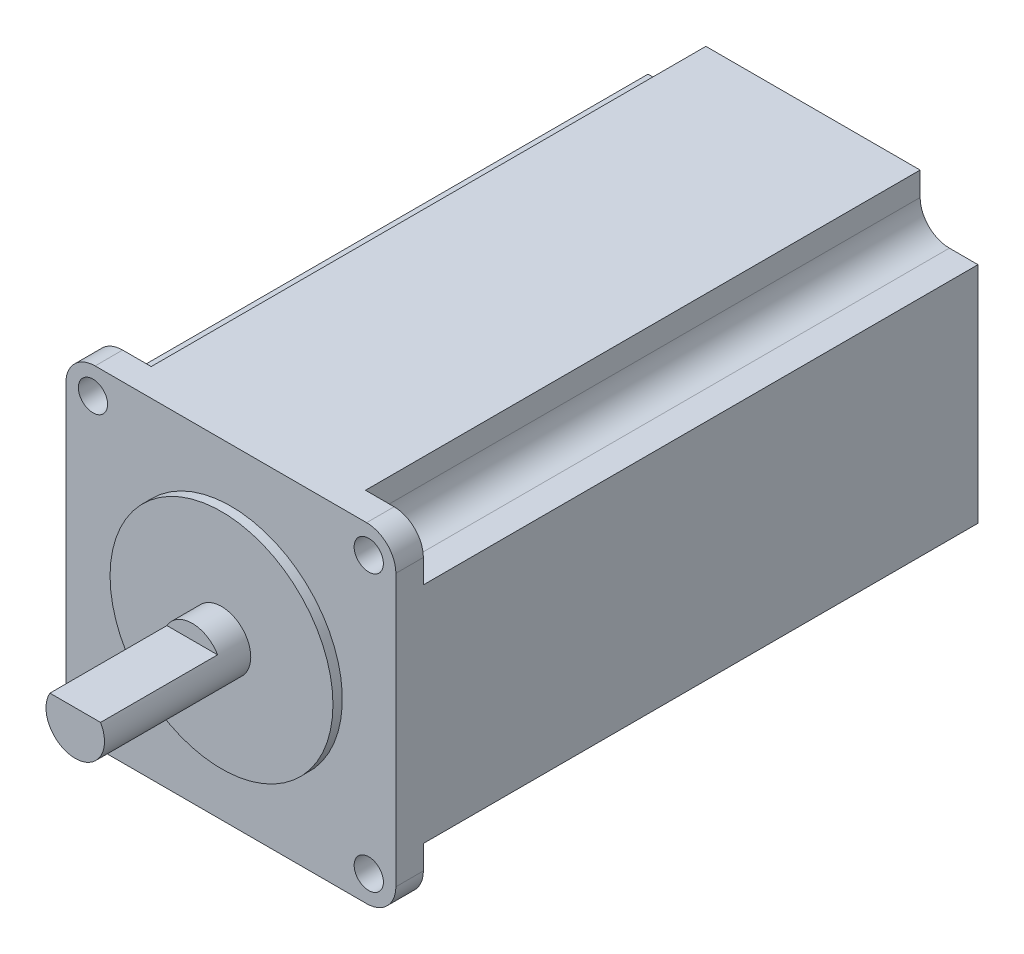
ISO-10303-21;
HEADER;
FILE_DESCRIPTION(('STEP AP214'),'2;1');
FILE_NAME('part.step','',(''),(''),'','','');
FILE_SCHEMA(('AUTOMOTIVE_DESIGN { 1 0 10303 214 1 1 1 1 }'));
ENDSEC;
DATA;
#1=APPLICATION_CONTEXT('core data for automotive mechanical design processes');
#2=APPLICATION_PROTOCOL_DEFINITION('international standard','automotive_design',2000,#1);
#3=PRODUCT_CONTEXT('',#1,'mechanical');
#4=PRODUCT('Part','Part','',(#3));
#5=PRODUCT_RELATED_PRODUCT_CATEGORY('part','',(#4));
#6=PRODUCT_DEFINITION_FORMATION('','',#4);
#7=PRODUCT_DEFINITION_CONTEXT('part definition',#1,'design');
#8=PRODUCT_DEFINITION('design','',#6,#7);
#9=PRODUCT_DEFINITION_SHAPE('','',#8);
#10=(LENGTH_UNIT() NAMED_UNIT(*) SI_UNIT(.MILLI.,.METRE.));
#11=(NAMED_UNIT(*) PLANE_ANGLE_UNIT() SI_UNIT($,.RADIAN.));
#12=(NAMED_UNIT(*) SI_UNIT($,.STERADIAN.) SOLID_ANGLE_UNIT());
#13=UNCERTAINTY_MEASURE_WITH_UNIT(LENGTH_MEASURE(1.E-05),#10,'distance_accuracy_value','');
#14=(GEOMETRIC_REPRESENTATION_CONTEXT(3) GLOBAL_UNCERTAINTY_ASSIGNED_CONTEXT((#13)) GLOBAL_UNIT_ASSIGNED_CONTEXT((#10,
#11,#12)) REPRESENTATION_CONTEXT('',''));
#15=CARTESIAN_POINT('',(0.,0.,0.));
#16=DIRECTION('',(0.,0.,1.));
#17=DIRECTION('',(1.,0.,0.));
#18=AXIS2_PLACEMENT_3D('',#15,#16,#17);
#19=CARTESIAN_POINT('',(0.,0.,99.5));
#20=DIRECTION('',(1.,0.,0.));
#21=DIRECTION('',(0.,0.,-1.));
#22=AXIS2_PLACEMENT_3D('',#19,#20,#21);
#23=PLANE('',#22);
#24=DIRECTION('',(0.,1.,0.));
#25=VECTOR('',#24,1.);
#26=CARTESIAN_POINT('',(0.,0.,94.8));
#27=LINE('',#26,#25);
#28=CARTESIAN_POINT('',(0.,5.,94.8));
#29=VERTEX_POINT('',#28);
#30=CARTESIAN_POINT('',(0.,9.05929943888165,94.8));
#31=VERTEX_POINT('',#30);
#32=EDGE_CURVE('E297',#29,#31,#27,.T.);
#33=ORIENTED_EDGE('',*,*,#32,.F.);
#34=DIRECTION('',(0.,0.,-1.));
#35=VECTOR('',#34,1.);
#36=CARTESIAN_POINT('',(0.,5.,99.5));
#37=LINE('',#36,#35);
#38=CARTESIAN_POINT('',(0.,5.,99.5));
#39=VERTEX_POINT('',#38);
#40=EDGE_CURVE('E411',#29,#39,#37,.F.);
#41=ORIENTED_EDGE('',*,*,#40,.T.);
#42=DIRECTION('',(0.,-1.,0.));
#43=VECTOR('',#42,1.);
#44=CARTESIAN_POINT('',(0.,0.,99.5));
#45=LINE('',#44,#43);
#46=CARTESIAN_POINT('',(0.,51.4,99.5));
#47=VERTEX_POINT('',#46);
#48=EDGE_CURVE('E345',#47,#39,#45,.T.);
#49=ORIENTED_EDGE('',*,*,#48,.F.);
#50=DIRECTION('',(0.,0.,-1.));
#51=VECTOR('',#50,1.);
#52=CARTESIAN_POINT('',(0.,51.4,99.5));
#53=LINE('',#52,#51);
#54=CARTESIAN_POINT('',(0.,51.4,94.8));
#55=VERTEX_POINT('',#54);
#56=EDGE_CURVE('E408',#47,#55,#53,.T.);
#57=ORIENTED_EDGE('',*,*,#56,.T.);
#58=DIRECTION('',(0.,-1.,0.));
#59=VECTOR('',#58,1.);
#60=CARTESIAN_POINT('',(0.,0.,94.8));
#61=LINE('',#60,#59);
#62=CARTESIAN_POINT('',(0.,47.3407005611183,94.8));
#63=VERTEX_POINT('',#62);
#64=EDGE_CURVE('E292',#55,#63,#61,.T.);
#65=ORIENTED_EDGE('',*,*,#64,.T.);
#66=DIRECTION('',(0.,0.,-1.));
#67=VECTOR('',#66,1.);
#68=CARTESIAN_POINT('',(0.,47.3407005611183,99.5));
#69=LINE('',#68,#67);
#70=CARTESIAN_POINT('',(0.,47.3407005611183,0.));
#71=VERTEX_POINT('',#70);
#72=EDGE_CURVE('E289',#63,#71,#69,.T.);
#73=ORIENTED_EDGE('',*,*,#72,.T.);
#74=DIRECTION('',(0.,-1.,0.));
#75=VECTOR('',#74,1.);
#76=CARTESIAN_POINT('',(0.,0.,0.));
#77=LINE('',#76,#75);
#78=CARTESIAN_POINT('',(0.,9.05929943888165,0.));
#79=VERTEX_POINT('',#78);
#80=EDGE_CURVE('E344',#71,#79,#77,.T.);
#81=ORIENTED_EDGE('',*,*,#80,.T.);
#82=DIRECTION('',(0.,0.,1.));
#83=VECTOR('',#82,1.);
#84=CARTESIAN_POINT('',(0.,9.05929943888165,99.5));
#85=LINE('',#84,#83);
#86=EDGE_CURVE('E281',#79,#31,#85,.T.);
#87=ORIENTED_EDGE('',*,*,#86,.T.);
#88=EDGE_LOOP('',(#33,#41,#49,#57,#65,#73,#81,#87));
#89=FACE_BOUND('',#88,.T.);
#90=ADVANCED_FACE('F35',(#89),#23,.F.);
#91=CARTESIAN_POINT('',(0.,0.,99.5));
#92=DIRECTION('',(0.,1.,0.));
#93=DIRECTION('',(0.,0.,1.));
#94=AXIS2_PLACEMENT_3D('',#91,#92,#93);
#95=PLANE('',#94);
#96=DIRECTION('',(1.,0.,0.));
#97=VECTOR('',#96,1.);
#98=CARTESIAN_POINT('',(0.,0.,99.5));
#99=LINE('',#98,#97);
#100=CARTESIAN_POINT('',(5.,0.,99.5));
#101=VERTEX_POINT('',#100);
#102=CARTESIAN_POINT('',(51.4,0.,99.5));
#103=VERTEX_POINT('',#102);
#104=EDGE_CURVE('E348',#101,#103,#99,.T.);
#105=ORIENTED_EDGE('',*,*,#104,.F.);
#106=DIRECTION('',(0.,0.,-1.));
#107=VECTOR('',#106,1.);
#108=CARTESIAN_POINT('',(5.,0.,99.5));
#109=LINE('',#108,#107);
#110=CARTESIAN_POINT('',(5.,0.,94.8));
#111=VERTEX_POINT('',#110);
#112=EDGE_CURVE('E403',#101,#111,#109,.T.);
#113=ORIENTED_EDGE('',*,*,#112,.T.);
#114=DIRECTION('',(-1.,0.,0.));
#115=VECTOR('',#114,1.);
#116=CARTESIAN_POINT('',(0.,0.,94.8));
#117=LINE('',#116,#115);
#118=CARTESIAN_POINT('',(9.88986238236256,0.,94.8));
#119=VERTEX_POINT('',#118);
#120=EDGE_CURVE('E385',#119,#111,#117,.T.);
#121=ORIENTED_EDGE('',*,*,#120,.F.);
#122=DIRECTION('',(0.,0.,-1.));
#123=VECTOR('',#122,1.);
#124=CARTESIAN_POINT('',(9.88986238236256,0.,99.5));
#125=LINE('',#124,#123);
#126=CARTESIAN_POINT('',(9.88986238236256,0.,0.));
#127=VERTEX_POINT('',#126);
#128=EDGE_CURVE('E284',#119,#127,#125,.T.);
#129=ORIENTED_EDGE('',*,*,#128,.T.);
#130=DIRECTION('',(1.,0.,0.));
#131=VECTOR('',#130,1.);
#132=CARTESIAN_POINT('',(0.,0.,0.));
#133=LINE('',#132,#131);
#134=CARTESIAN_POINT('',(46.5101376176374,0.,0.));
#135=VERTEX_POINT('',#134);
#136=EDGE_CURVE('E361',#127,#135,#133,.T.);
#137=ORIENTED_EDGE('',*,*,#136,.T.);
#138=DIRECTION('',(0.,0.,1.));
#139=VECTOR('',#138,1.);
#140=CARTESIAN_POINT('',(46.5101376176374,0.,99.5));
#141=LINE('',#140,#139);
#142=CARTESIAN_POINT('',(46.5101376176374,0.,94.8));
#143=VERTEX_POINT('',#142);
#144=EDGE_CURVE('E278',#135,#143,#141,.T.);
#145=ORIENTED_EDGE('',*,*,#144,.T.);
#146=DIRECTION('',(1.,0.,0.));
#147=VECTOR('',#146,1.);
#148=CARTESIAN_POINT('',(0.,0.,94.8));
#149=LINE('',#148,#147);
#150=CARTESIAN_POINT('',(51.4,0.,94.8));
#151=VERTEX_POINT('',#150);
#152=EDGE_CURVE('E294',#143,#151,#149,.T.);
#153=ORIENTED_EDGE('',*,*,#152,.T.);
#154=DIRECTION('',(0.,0.,-1.));
#155=VECTOR('',#154,1.);
#156=CARTESIAN_POINT('',(51.4,0.,99.5));
#157=LINE('',#156,#155);
#158=EDGE_CURVE('E388',#151,#103,#157,.F.);
#159=ORIENTED_EDGE('',*,*,#158,.T.);
#160=EDGE_LOOP('',(#105,#113,#121,#129,#137,#145,#153,#159));
#161=FACE_BOUND('',#160,.T.);
#162=ADVANCED_FACE('F473',(#161),#95,.F.);
#163=CARTESIAN_POINT('',(56.4,0.,99.5));
#164=DIRECTION('',(-1.,0.,0.));
#165=DIRECTION('',(0.,0.,1.));
#166=AXIS2_PLACEMENT_3D('',#163,#164,#165);
#167=PLANE('',#166);
#168=DIRECTION('',(0.,1.,0.));
#169=VECTOR('',#168,1.);
#170=CARTESIAN_POINT('',(56.4,0.,99.5));
#171=LINE('',#170,#169);
#172=CARTESIAN_POINT('',(56.4,5.,99.5));
#173=VERTEX_POINT('',#172);
#174=CARTESIAN_POINT('',(56.4,51.4,99.5));
#175=VERTEX_POINT('',#174);
#176=EDGE_CURVE('E352',#173,#175,#171,.T.);
#177=ORIENTED_EDGE('',*,*,#176,.F.);
#178=DIRECTION('',(0.,0.,-1.));
#179=VECTOR('',#178,1.);
#180=CARTESIAN_POINT('',(56.4,5.,99.5));
#181=LINE('',#180,#179);
#182=CARTESIAN_POINT('',(56.4,5.,94.8));
#183=VERTEX_POINT('',#182);
#184=EDGE_CURVE('E423',#173,#183,#181,.T.);
#185=ORIENTED_EDGE('',*,*,#184,.T.);
#186=DIRECTION('',(0.,1.,0.));
#187=VECTOR('',#186,1.);
#188=CARTESIAN_POINT('',(56.4,0.,94.8));
#189=LINE('',#188,#187);
#190=CARTESIAN_POINT('',(56.4,9.05929943888165,94.8));
#191=VERTEX_POINT('',#190);
#192=EDGE_CURVE('E383',#183,#191,#189,.T.);
#193=ORIENTED_EDGE('',*,*,#192,.T.);
#194=DIRECTION('',(0.,0.,-1.));
#195=VECTOR('',#194,1.);
#196=CARTESIAN_POINT('',(56.4,9.05929943888165,99.5));
#197=LINE('',#196,#195);
#198=CARTESIAN_POINT('',(56.4,9.05929943888165,0.));
#199=VERTEX_POINT('',#198);
#200=EDGE_CURVE('E238',#191,#199,#197,.T.);
#201=ORIENTED_EDGE('',*,*,#200,.T.);
#202=DIRECTION('',(0.,1.,0.));
#203=VECTOR('',#202,1.);
#204=CARTESIAN_POINT('',(56.4,0.,0.));
#205=LINE('',#204,#203);
#206=CARTESIAN_POINT('',(56.4,47.3407005611183,0.));
#207=VERTEX_POINT('',#206);
#208=EDGE_CURVE('E364',#199,#207,#205,.T.);
#209=ORIENTED_EDGE('',*,*,#208,.T.);
#210=DIRECTION('',(0.,0.,1.));
#211=VECTOR('',#210,1.);
#212=CARTESIAN_POINT('',(56.4,47.3407005611183,99.5));
#213=LINE('',#212,#211);
#214=CARTESIAN_POINT('',(56.4,47.3407005611183,94.8));
#215=VERTEX_POINT('',#214);
#216=EDGE_CURVE('E315',#207,#215,#213,.T.);
#217=ORIENTED_EDGE('',*,*,#216,.T.);
#218=DIRECTION('',(0.,-1.,0.));
#219=VECTOR('',#218,1.);
#220=CARTESIAN_POINT('',(56.4,0.,94.8));
#221=LINE('',#220,#219);
#222=CARTESIAN_POINT('',(56.4,51.4,94.8));
#223=VERTEX_POINT('',#222);
#224=EDGE_CURVE('E323',#223,#215,#221,.T.);
#225=ORIENTED_EDGE('',*,*,#224,.F.);
#226=DIRECTION('',(0.,0.,-1.));
#227=VECTOR('',#226,1.);
#228=CARTESIAN_POINT('',(56.4,51.4,99.5));
#229=LINE('',#228,#227);
#230=EDGE_CURVE('E421',#223,#175,#229,.F.);
#231=ORIENTED_EDGE('',*,*,#230,.T.);
#232=EDGE_LOOP('',(#177,#185,#193,#201,#209,#217,#225,#231));
#233=FACE_BOUND('',#232,.T.);
#234=ADVANCED_FACE('F480',(#233),#167,.F.);
#235=CARTESIAN_POINT('',(0.,56.4,99.5));
#236=DIRECTION('',(0.,-1.,0.));
#237=DIRECTION('',(0.,0.,-1.));
#238=AXIS2_PLACEMENT_3D('',#235,#236,#237);
#239=PLANE('',#238);
#240=DIRECTION('',(-1.,0.,0.));
#241=VECTOR('',#240,1.);
#242=CARTESIAN_POINT('',(0.,56.4,94.8));
#243=LINE('',#242,#241);
#244=CARTESIAN_POINT('',(9.88986238236256,56.4,94.8));
#245=VERTEX_POINT('',#244);
#246=CARTESIAN_POINT('',(5.,56.4,94.8));
#247=VERTEX_POINT('',#246);
#248=EDGE_CURVE('E212',#245,#247,#243,.T.);
#249=ORIENTED_EDGE('',*,*,#248,.T.);
#250=DIRECTION('',(0.,0.,-1.));
#251=VECTOR('',#250,1.);
#252=CARTESIAN_POINT('',(5.,56.4,99.5));
#253=LINE('',#252,#251);
#254=CARTESIAN_POINT('',(5.,56.4,99.5));
#255=VERTEX_POINT('',#254);
#256=EDGE_CURVE('E43',#247,#255,#253,.F.);
#257=ORIENTED_EDGE('',*,*,#256,.T.);
#258=DIRECTION('',(-1.,0.,0.));
#259=VECTOR('',#258,1.);
#260=CARTESIAN_POINT('',(0.,56.4,99.5));
#261=LINE('',#260,#259);
#262=CARTESIAN_POINT('',(51.4,56.4,99.5));
#263=VERTEX_POINT('',#262);
#264=EDGE_CURVE('E355',#263,#255,#261,.T.);
#265=ORIENTED_EDGE('',*,*,#264,.F.);
#266=DIRECTION('',(0.,0.,-1.));
#267=VECTOR('',#266,1.);
#268=CARTESIAN_POINT('',(51.4,56.4,99.5));
#269=LINE('',#268,#267);
#270=CARTESIAN_POINT('',(51.4,56.4,94.8));
#271=VERTEX_POINT('',#270);
#272=EDGE_CURVE('E429',#263,#271,#269,.T.);
#273=ORIENTED_EDGE('',*,*,#272,.T.);
#274=DIRECTION('',(1.,0.,0.));
#275=VECTOR('',#274,1.);
#276=CARTESIAN_POINT('',(0.,56.4,94.8));
#277=LINE('',#276,#275);
#278=CARTESIAN_POINT('',(46.5101376176374,56.4,94.8));
#279=VERTEX_POINT('',#278);
#280=EDGE_CURVE('E374',#279,#271,#277,.T.);
#281=ORIENTED_EDGE('',*,*,#280,.F.);
#282=DIRECTION('',(0.,0.,-1.));
#283=VECTOR('',#282,1.);
#284=CARTESIAN_POINT('',(46.5101376176374,56.4,99.5));
#285=LINE('',#284,#283);
#286=CARTESIAN_POINT('',(46.5101376176374,56.4,0.));
#287=VERTEX_POINT('',#286);
#288=EDGE_CURVE('E320',#279,#287,#285,.T.);
#289=ORIENTED_EDGE('',*,*,#288,.T.);
#290=DIRECTION('',(-1.,0.,0.));
#291=VECTOR('',#290,1.);
#292=CARTESIAN_POINT('',(0.,56.4,0.));
#293=LINE('',#292,#291);
#294=CARTESIAN_POINT('',(9.88986238236256,56.4,0.));
#295=VERTEX_POINT('',#294);
#296=EDGE_CURVE('E349',#287,#295,#293,.T.);
#297=ORIENTED_EDGE('',*,*,#296,.T.);
#298=DIRECTION('',(0.,0.,1.));
#299=VECTOR('',#298,1.);
#300=CARTESIAN_POINT('',(9.88986238236256,56.4,99.5));
#301=LINE('',#300,#299);
#302=EDGE_CURVE('E287',#295,#245,#301,.T.);
#303=ORIENTED_EDGE('',*,*,#302,.T.);
#304=EDGE_LOOP('',(#249,#257,#265,#273,#281,#289,#297,#303));
#305=FACE_BOUND('',#304,.T.);
#306=ADVANCED_FACE('F433',(#305),#239,.F.);
#307=CARTESIAN_POINT('',(0.,0.,99.5));
#308=DIRECTION('',(0.,0.,-1.));
#309=DIRECTION('',(-1.,0.,0.));
#310=AXIS2_PLACEMENT_3D('',#307,#308,#309);
#311=PLANE('',#310);
#312=CARTESIAN_POINT('',(51.77,51.77,99.5));
#313=DIRECTION('',(0.,0.,1.));
#314=DIRECTION('',(-1.,0.,0.));
#315=AXIS2_PLACEMENT_3D('',#312,#313,#314);
#316=CIRCLE('',#315,2.5);
#317=CARTESIAN_POINT('',(49.27,51.77,99.5));
#318=VERTEX_POINT('',#317);
#319=EDGE_CURVE('E396',#318,#318,#316,.T.);
#320=ORIENTED_EDGE('',*,*,#319,.F.);
#321=EDGE_LOOP('',(#320));
#322=FACE_BOUND('',#321,.T.);
#323=CARTESIAN_POINT('',(51.77,4.63,99.5));
#324=DIRECTION('',(0.,0.,1.));
#325=DIRECTION('',(1.,0.,0.));
#326=AXIS2_PLACEMENT_3D('',#323,#324,#325);
#327=CIRCLE('',#326,2.49999999999999);
#328=CARTESIAN_POINT('',(54.27,4.63,99.5));
#329=VERTEX_POINT('',#328);
#330=EDGE_CURVE('E852',#329,#329,#327,.T.);
#331=ORIENTED_EDGE('',*,*,#330,.F.);
#332=EDGE_LOOP('',(#331));
#333=FACE_BOUND('',#332,.T.);
#334=CARTESIAN_POINT('',(4.63,4.63,99.5));
#335=DIRECTION('',(0.,0.,1.));
#336=DIRECTION('',(-1.,0.,0.));
#337=AXIS2_PLACEMENT_3D('',#334,#335,#336);
#338=CIRCLE('',#337,2.5);
#339=CARTESIAN_POINT('',(2.13,4.63,99.5));
#340=VERTEX_POINT('',#339);
#341=EDGE_CURVE('E849',#340,#340,#338,.T.);
#342=ORIENTED_EDGE('',*,*,#341,.F.);
#343=EDGE_LOOP('',(#342));
#344=FACE_BOUND('',#343,.T.);
#345=CARTESIAN_POINT('',(4.63,51.77,99.5));
#346=DIRECTION('',(0.,0.,1.));
#347=DIRECTION('',(1.,0.,0.));
#348=AXIS2_PLACEMENT_3D('',#345,#346,#347);
#349=CIRCLE('',#348,2.5);
#350=CARTESIAN_POINT('',(7.13,51.77,99.5));
#351=VERTEX_POINT('',#350);
#352=EDGE_CURVE('E391',#351,#351,#349,.T.);
#353=ORIENTED_EDGE('',*,*,#352,.F.);
#354=EDGE_LOOP('',(#353));
#355=FACE_BOUND('',#354,.T.);
#356=CARTESIAN_POINT('',(28.2,28.2,99.5));
#357=DIRECTION('',(0.,0.,-1.));
#358=DIRECTION('',(-1.,0.,0.));
#359=AXIS2_PLACEMENT_3D('',#356,#357,#358);
#360=CIRCLE('',#359,19.05);
#361=CARTESIAN_POINT('',(9.15,28.2,99.5));
#362=VERTEX_POINT('',#361);
#363=EDGE_CURVE('E358',#362,#362,#360,.F.);
#364=ORIENTED_EDGE('',*,*,#363,.F.);
#365=EDGE_LOOP('',(#364));
#366=FACE_BOUND('',#365,.T.);
#367=ORIENTED_EDGE('',*,*,#48,.T.);
#368=CARTESIAN_POINT('',(5.,5.,99.5));
#369=DIRECTION('',(0.,0.,-1.));
#370=DIRECTION('',(-1.,0.,0.));
#371=AXIS2_PLACEMENT_3D('',#368,#369,#370);
#372=CIRCLE('',#371,5.);
#373=EDGE_CURVE('E419',#39,#101,#372,.F.);
#374=ORIENTED_EDGE('',*,*,#373,.T.);
#375=ORIENTED_EDGE('',*,*,#104,.T.);
#376=CARTESIAN_POINT('',(51.4,5.,99.5));
#377=DIRECTION('',(0.,0.,-1.));
#378=DIRECTION('',(-1.,0.,0.));
#379=AXIS2_PLACEMENT_3D('',#376,#377,#378);
#380=CIRCLE('',#379,5.);
#381=EDGE_CURVE('E417',#103,#173,#380,.F.);
#382=ORIENTED_EDGE('',*,*,#381,.T.);
#383=ORIENTED_EDGE('',*,*,#176,.T.);
#384=CARTESIAN_POINT('',(51.4,51.4,99.5));
#385=DIRECTION('',(0.,0.,-1.));
#386=DIRECTION('',(-1.,0.,0.));
#387=AXIS2_PLACEMENT_3D('',#384,#385,#386);
#388=CIRCLE('',#387,5.);
#389=EDGE_CURVE('E413',#175,#263,#388,.F.);
#390=ORIENTED_EDGE('',*,*,#389,.T.);
#391=ORIENTED_EDGE('',*,*,#264,.T.);
#392=CARTESIAN_POINT('',(5.,51.4,99.5));
#393=DIRECTION('',(0.,0.,-1.));
#394=DIRECTION('',(-1.,0.,0.));
#395=AXIS2_PLACEMENT_3D('',#392,#393,#394);
#396=CIRCLE('',#395,5.);
#397=EDGE_CURVE('E415',#255,#47,#396,.F.);
#398=ORIENTED_EDGE('',*,*,#397,.T.);
#399=EDGE_LOOP('',(#367,#374,#375,#382,#383,#390,#391,#398));
#400=FACE_BOUND('',#399,.T.);
#401=ADVANCED_FACE('F437',(#322,#333,#344,#355,#366,#400),#311,.F.);
#402=CARTESIAN_POINT('',(0.,0.,0.));
#403=DIRECTION('',(0.,0.,-1.));
#404=DIRECTION('',(-1.,0.,0.));
#405=AXIS2_PLACEMENT_3D('',#402,#403,#404);
#406=PLANE('',#405);
#407=DIRECTION('',(-1.,0.,0.));
#408=VECTOR('',#407,1.);
#409=CARTESIAN_POINT('',(-5.58881065522786,47.3407005611183,0.));
#410=LINE('',#409,#408);
#411=CARTESIAN_POINT('',(4.88986238236251,47.3407005611183,0.));
#412=VERTEX_POINT('',#411);
#413=EDGE_CURVE('E215',#412,#71,#410,.T.);
#414=ORIENTED_EDGE('',*,*,#413,.F.);
#415=CARTESIAN_POINT('',(4.88986238236256,52.3407005611183,0.));
#416=DIRECTION('',(0.,0.,-1.));
#417=DIRECTION('',(1.,0.,0.));
#418=AXIS2_PLACEMENT_3D('',#415,#416,#417);
#419=CIRCLE('',#418,5.);
#420=CARTESIAN_POINT('',(9.88986238236256,52.3407005611184,0.));
#421=VERTEX_POINT('',#420);
#422=EDGE_CURVE('E234',#421,#412,#419,.T.);
#423=ORIENTED_EDGE('',*,*,#422,.F.);
#424=DIRECTION('',(0.,-1.,0.));
#425=VECTOR('',#424,1.);
#426=CARTESIAN_POINT('',(9.88986238236256,0.,0.));
#427=LINE('',#426,#425);
#428=EDGE_CURVE('E221',#295,#421,#427,.T.);
#429=ORIENTED_EDGE('',*,*,#428,.F.);
#430=ORIENTED_EDGE('',*,*,#296,.F.);
#431=DIRECTION('',(0.,1.,0.));
#432=VECTOR('',#431,1.);
#433=CARTESIAN_POINT('',(46.5101376176374,58.0625131042298,0.));
#434=LINE('',#433,#432);
#435=CARTESIAN_POINT('',(46.5101376176374,52.3407005611184,0.));
#436=VERTEX_POINT('',#435);
#437=EDGE_CURVE('E303',#436,#287,#434,.T.);
#438=ORIENTED_EDGE('',*,*,#437,.F.);
#439=CARTESIAN_POINT('',(51.5101376176374,52.3407005611183,0.));
#440=DIRECTION('',(0.,0.,-1.));
#441=DIRECTION('',(-1.,0.,0.));
#442=AXIS2_PLACEMENT_3D('',#439,#440,#441);
#443=CIRCLE('',#442,5.);
#444=CARTESIAN_POINT('',(51.5101376176375,47.3407005611183,0.));
#445=VERTEX_POINT('',#444);
#446=EDGE_CURVE('E299',#445,#436,#443,.T.);
#447=ORIENTED_EDGE('',*,*,#446,.F.);
#448=DIRECTION('',(-1.,0.,0.));
#449=VECTOR('',#448,1.);
#450=CARTESIAN_POINT('',(0.,47.3407005611183,0.));
#451=LINE('',#450,#449);
#452=EDGE_CURVE('E372',#207,#445,#451,.T.);
#453=ORIENTED_EDGE('',*,*,#452,.F.);
#454=ORIENTED_EDGE('',*,*,#208,.F.);
#455=DIRECTION('',(1.,0.,0.));
#456=VECTOR('',#455,1.);
#457=CARTESIAN_POINT('',(61.9888106552279,9.05929943888165,0.));
#458=LINE('',#457,#456);
#459=CARTESIAN_POINT('',(51.5101376176375,9.05929943888165,0.));
#460=VERTEX_POINT('',#459);
#461=EDGE_CURVE('E262',#460,#199,#458,.T.);
#462=ORIENTED_EDGE('',*,*,#461,.F.);
#463=CARTESIAN_POINT('',(51.5101376176374,4.05929943888166,0.));
#464=DIRECTION('',(0.,0.,-1.));
#465=DIRECTION('',(1.,0.,0.));
#466=AXIS2_PLACEMENT_3D('',#463,#464,#465);
#467=CIRCLE('',#466,5.);
#468=CARTESIAN_POINT('',(46.5101376176374,4.05929943888162,0.));
#469=VERTEX_POINT('',#468);
#470=EDGE_CURVE('E268',#469,#460,#467,.T.);
#471=ORIENTED_EDGE('',*,*,#470,.F.);
#472=DIRECTION('',(0.,1.,0.));
#473=VECTOR('',#472,1.);
#474=CARTESIAN_POINT('',(46.5101376176374,0.,0.));
#475=LINE('',#474,#473);
#476=EDGE_CURVE('E377',#135,#469,#475,.T.);
#477=ORIENTED_EDGE('',*,*,#476,.F.);
#478=ORIENTED_EDGE('',*,*,#136,.F.);
#479=DIRECTION('',(0.,-1.,0.));
#480=VECTOR('',#479,1.);
#481=CARTESIAN_POINT('',(9.88986238236256,-1.66251310422976,0.));
#482=LINE('',#481,#480);
#483=CARTESIAN_POINT('',(9.88986238236256,4.05929943888162,0.));
#484=VERTEX_POINT('',#483);
#485=EDGE_CURVE('E243',#484,#127,#482,.T.);
#486=ORIENTED_EDGE('',*,*,#485,.F.);
#487=CARTESIAN_POINT('',(4.88986238236256,4.05929943888166,0.));
#488=DIRECTION('',(0.,0.,-1.));
#489=DIRECTION('',(-1.,0.,0.));
#490=AXIS2_PLACEMENT_3D('',#487,#488,#489);
#491=CIRCLE('',#490,5.);
#492=CARTESIAN_POINT('',(4.88986238236252,9.05929943888165,0.));
#493=VERTEX_POINT('',#492);
#494=EDGE_CURVE('E250',#493,#484,#491,.T.);
#495=ORIENTED_EDGE('',*,*,#494,.F.);
#496=DIRECTION('',(1.,0.,0.));
#497=VECTOR('',#496,1.);
#498=CARTESIAN_POINT('',(0.,9.05929943888165,0.));
#499=LINE('',#498,#497);
#500=EDGE_CURVE('E379',#79,#493,#499,.T.);
#501=ORIENTED_EDGE('',*,*,#500,.F.);
#502=ORIENTED_EDGE('',*,*,#80,.F.);
#503=EDGE_LOOP('',(#414,#423,#429,#430,#438,#447,#453,#454,#462,#471,#477,#478,#486,#495,#501,#502));
#504=FACE_BOUND('',#503,.T.);
#505=ADVANCED_FACE('F451',(#504),#406,.T.);
#506=CARTESIAN_POINT('',(28.2,28.2,101.1));
#507=DIRECTION('',(0.,0.,-1.));
#508=DIRECTION('',(-1.,0.,0.));
#509=AXIS2_PLACEMENT_3D('',#506,#507,#508);
#510=CYLINDRICAL_SURFACE('',#509,19.05);
#511=CARTESIAN_POINT('',(28.2,28.2,101.1));
#512=DIRECTION('',(0.,0.,1.));
#513=DIRECTION('',(1.,0.,0.));
#514=AXIS2_PLACEMENT_3D('',#511,#512,#513);
#515=CIRCLE('',#514,19.05);
#516=CARTESIAN_POINT('',(47.25,28.2,101.1));
#517=VERTEX_POINT('',#516);
#518=EDGE_CURVE('E339',#517,#517,#515,.T.);
#519=ORIENTED_EDGE('',*,*,#518,.F.);
#520=EDGE_LOOP('',(#519));
#521=FACE_BOUND('',#520,.T.);
#522=ORIENTED_EDGE('',*,*,#363,.T.);
#523=EDGE_LOOP('',(#522));
#524=FACE_BOUND('',#523,.T.);
#525=ADVANCED_FACE('F771',(#521,#524),#510,.T.);
#526=CARTESIAN_POINT('',(28.2,28.2,101.1));
#527=DIRECTION('',(0.,0.,1.));
#528=DIRECTION('',(1.,0.,0.));
#529=AXIS2_PLACEMENT_3D('',#526,#527,#528);
#530=PLANE('',#529);
#531=CARTESIAN_POINT('',(28.2,28.2,101.1));
#532=DIRECTION('',(0.,0.,1.));
#533=DIRECTION('',(1.,0.,0.));
#534=AXIS2_PLACEMENT_3D('',#531,#532,#533);
#535=CIRCLE('',#534,5.);
#536=CARTESIAN_POINT('',(33.2,28.2,101.1));
#537=VERTEX_POINT('',#536);
#538=EDGE_CURVE('E334',#537,#537,#535,.T.);
#539=ORIENTED_EDGE('',*,*,#538,.F.);
#540=EDGE_LOOP('',(#539));
#541=FACE_BOUND('',#540,.T.);
#542=ORIENTED_EDGE('',*,*,#518,.T.);
#543=EDGE_LOOP('',(#542));
#544=FACE_BOUND('',#543,.T.);
#545=ADVANCED_FACE('F810',(#541,#544),#530,.T.);
#546=CARTESIAN_POINT('',(28.2,28.2,126.1));
#547=DIRECTION('',(0.,0.,-1.));
#548=DIRECTION('',(-1.,0.,0.));
#549=AXIS2_PLACEMENT_3D('',#546,#547,#548);
#550=CYLINDRICAL_SURFACE('',#549,5.);
#551=CARTESIAN_POINT('',(28.2,28.2,126.1));
#552=DIRECTION('',(0.,0.,1.));
#553=DIRECTION('',(1.,0.,0.));
#554=AXIS2_PLACEMENT_3D('',#551,#552,#553);
#555=CIRCLE('',#554,5.);
#556=CARTESIAN_POINT('',(23.8698729810778,30.7,126.1));
#557=VERTEX_POINT('',#556);
#558=CARTESIAN_POINT('',(32.5301270189222,30.7,126.1));
#559=VERTEX_POINT('',#558);
#560=EDGE_CURVE('E336',#557,#559,#555,.T.);
#561=ORIENTED_EDGE('',*,*,#560,.F.);
#562=DIRECTION('',(0.,0.,1.));
#563=VECTOR('',#562,1.);
#564=CARTESIAN_POINT('',(23.8698729810778,30.7,106.1));
#565=LINE('',#564,#563);
#566=CARTESIAN_POINT('',(23.8698729810778,30.7,106.1));
#567=VERTEX_POINT('',#566);
#568=EDGE_CURVE('E329',#567,#557,#565,.T.);
#569=ORIENTED_EDGE('',*,*,#568,.F.);
#570=CARTESIAN_POINT('',(28.2,28.2,106.1));
#571=DIRECTION('',(0.,0.,1.));
#572=DIRECTION('',(1.,0.,0.));
#573=AXIS2_PLACEMENT_3D('',#570,#571,#572);
#574=CIRCLE('',#573,5.);
#575=CARTESIAN_POINT('',(32.5301270189222,30.7,106.1));
#576=VERTEX_POINT('',#575);
#577=EDGE_CURVE('E370',#576,#567,#574,.T.);
#578=ORIENTED_EDGE('',*,*,#577,.F.);
#579=DIRECTION('',(0.,0.,1.));
#580=VECTOR('',#579,1.);
#581=CARTESIAN_POINT('',(32.5301270189222,30.7,106.1));
#582=LINE('',#581,#580);
#583=EDGE_CURVE('E331',#576,#559,#582,.T.);
#584=ORIENTED_EDGE('',*,*,#583,.T.);
#585=EDGE_LOOP('',(#561,#569,#578,#584));
#586=FACE_BOUND('',#585,.T.);
#587=ORIENTED_EDGE('',*,*,#538,.T.);
#588=EDGE_LOOP('',(#587));
#589=FACE_BOUND('',#588,.T.);
#590=ADVANCED_FACE('F800',(#586,#589),#550,.T.);
#591=CARTESIAN_POINT('',(28.2,28.2,126.1));
#592=DIRECTION('',(0.,0.,1.));
#593=DIRECTION('',(1.,0.,0.));
#594=AXIS2_PLACEMENT_3D('',#591,#592,#593);
#595=PLANE('',#594);
#596=DIRECTION('',(1.,0.,0.));
#597=VECTOR('',#596,1.);
#598=CARTESIAN_POINT('',(23.8698729810778,30.7,126.1));
#599=LINE('',#598,#597);
#600=EDGE_CURVE('E325',#557,#559,#599,.T.);
#601=ORIENTED_EDGE('',*,*,#600,.F.);
#602=ORIENTED_EDGE('',*,*,#560,.T.);
#603=EDGE_LOOP('',(#601,#602));
#604=FACE_BOUND('',#603,.T.);
#605=ADVANCED_FACE('F790',(#604),#595,.T.);
#606=CARTESIAN_POINT('',(0.,0.,106.1));
#607=DIRECTION('',(0.,0.,1.));
#608=DIRECTION('',(1.,0.,0.));
#609=AXIS2_PLACEMENT_3D('',#606,#607,#608);
#610=PLANE('',#609);
#611=ORIENTED_EDGE('',*,*,#577,.T.);
#612=DIRECTION('',(1.,0.,0.));
#613=VECTOR('',#612,1.);
#614=CARTESIAN_POINT('',(23.8698729810778,30.7,106.1));
#615=LINE('',#614,#613);
#616=EDGE_CURVE('E326',#567,#576,#615,.T.);
#617=ORIENTED_EDGE('',*,*,#616,.T.);
#618=EDGE_LOOP('',(#611,#617));
#619=FACE_BOUND('',#618,.T.);
#620=ADVANCED_FACE('F780',(#619),#610,.T.);
#621=CARTESIAN_POINT('',(23.8698729810778,30.7,106.1));
#622=DIRECTION('',(0.,-1.,0.));
#623=DIRECTION('',(0.,0.,-1.));
#624=AXIS2_PLACEMENT_3D('',#621,#622,#623);
#625=PLANE('',#624);
#626=ORIENTED_EDGE('',*,*,#600,.T.);
#627=ORIENTED_EDGE('',*,*,#583,.F.);
#628=ORIENTED_EDGE('',*,*,#616,.F.);
#629=ORIENTED_EDGE('',*,*,#568,.T.);
#630=EDGE_LOOP('',(#626,#627,#628,#629));
#631=FACE_BOUND('',#630,.T.);
#632=ADVANCED_FACE('F610',(#631),#625,.F.);
#633=CARTESIAN_POINT('',(51.5101376176374,52.3407005611183,94.8));
#634=DIRECTION('',(0.,0.,-1.));
#635=DIRECTION('',(-1.,0.,0.));
#636=AXIS2_PLACEMENT_3D('',#633,#634,#635);
#637=PLANE('',#636);
#638=CARTESIAN_POINT('',(51.77,51.77,94.8));
#639=DIRECTION('',(0.,0.,-1.));
#640=DIRECTION('',(-1.,0.,0.));
#641=AXIS2_PLACEMENT_3D('',#638,#639,#640);
#642=CIRCLE('',#641,2.5);
#643=CARTESIAN_POINT('',(49.27,51.77,94.8));
#644=VERTEX_POINT('',#643);
#645=EDGE_CURVE('E399',#644,#644,#642,.T.);
#646=ORIENTED_EDGE('',*,*,#645,.F.);
#647=EDGE_LOOP('',(#646));
#648=FACE_BOUND('',#647,.T.);
#649=ORIENTED_EDGE('',*,*,#280,.T.);
#650=CARTESIAN_POINT('',(51.4,51.4,94.8));
#651=DIRECTION('',(0.,0.,-1.));
#652=DIRECTION('',(-1.,0.,0.));
#653=AXIS2_PLACEMENT_3D('',#650,#651,#652);
#654=CIRCLE('',#653,5.);
#655=EDGE_CURVE('E11',#271,#223,#654,.T.);
#656=ORIENTED_EDGE('',*,*,#655,.T.);
#657=ORIENTED_EDGE('',*,*,#224,.T.);
#658=DIRECTION('',(-1.,0.,0.));
#659=VECTOR('',#658,1.);
#660=CARTESIAN_POINT('',(61.9888106552279,47.3407005611183,94.8));
#661=LINE('',#660,#659);
#662=CARTESIAN_POINT('',(51.5101376176375,47.3407005611183,94.8));
#663=VERTEX_POINT('',#662);
#664=EDGE_CURVE('E300',#215,#663,#661,.T.);
#665=ORIENTED_EDGE('',*,*,#664,.T.);
#666=CARTESIAN_POINT('',(51.5101376176374,52.3407005611183,94.8));
#667=DIRECTION('',(0.,0.,-1.));
#668=DIRECTION('',(-1.,0.,0.));
#669=AXIS2_PLACEMENT_3D('',#666,#667,#668);
#670=CIRCLE('',#669,5.);
#671=CARTESIAN_POINT('',(46.5101376176374,52.3407005611184,94.8));
#672=VERTEX_POINT('',#671);
#673=EDGE_CURVE('E302',#663,#672,#670,.T.);
#674=ORIENTED_EDGE('',*,*,#673,.T.);
#675=DIRECTION('',(0.,1.,0.));
#676=VECTOR('',#675,1.);
#677=CARTESIAN_POINT('',(46.5101376176374,58.0625131042298,94.8));
#678=LINE('',#677,#676);
#679=EDGE_CURVE('E306',#672,#279,#678,.T.);
#680=ORIENTED_EDGE('',*,*,#679,.T.);
#681=EDGE_LOOP('',(#649,#656,#657,#665,#674,#680));
#682=FACE_BOUND('',#681,.T.);
#683=ADVANCED_FACE('F485',(#648,#682),#637,.T.);
#684=CARTESIAN_POINT('',(46.5101376176374,58.0625131042298,94.8));
#685=DIRECTION('',(-1.,0.,0.));
#686=DIRECTION('',(0.,0.,1.));
#687=AXIS2_PLACEMENT_3D('',#684,#685,#686);
#688=PLANE('',#687);
#689=ORIENTED_EDGE('',*,*,#679,.F.);
#690=DIRECTION('',(0.,0.,-1.));
#691=VECTOR('',#690,1.);
#692=CARTESIAN_POINT('',(46.5101376176374,52.3407005611184,94.8));
#693=LINE('',#692,#691);
#694=EDGE_CURVE('E313',#672,#436,#693,.T.);
#695=ORIENTED_EDGE('',*,*,#694,.T.);
#696=ORIENTED_EDGE('',*,*,#437,.T.);
#697=ORIENTED_EDGE('',*,*,#288,.F.);
#698=EDGE_LOOP('',(#689,#695,#696,#697));
#699=FACE_BOUND('',#698,.T.);
#700=ADVANCED_FACE('F489',(#699),#688,.F.);
#701=CARTESIAN_POINT('',(61.9888106552279,47.3407005611183,94.8));
#702=DIRECTION('',(0.,-1.,0.));
#703=DIRECTION('',(0.,0.,-1.));
#704=AXIS2_PLACEMENT_3D('',#701,#702,#703);
#705=PLANE('',#704);
#706=ORIENTED_EDGE('',*,*,#452,.T.);
#707=DIRECTION('',(0.,0.,-1.));
#708=VECTOR('',#707,1.);
#709=CARTESIAN_POINT('',(51.5101376176375,47.3407005611183,94.8));
#710=LINE('',#709,#708);
#711=EDGE_CURVE('E309',#663,#445,#710,.T.);
#712=ORIENTED_EDGE('',*,*,#711,.F.);
#713=ORIENTED_EDGE('',*,*,#664,.F.);
#714=ORIENTED_EDGE('',*,*,#216,.F.);
#715=EDGE_LOOP('',(#706,#712,#713,#714));
#716=FACE_BOUND('',#715,.T.);
#717=ADVANCED_FACE('F500',(#716),#705,.F.);
#718=CARTESIAN_POINT('',(51.5101376176374,52.3407005611183,94.8));
#719=DIRECTION('',(0.,0.,-1.));
#720=DIRECTION('',(-1.,0.,0.));
#721=AXIS2_PLACEMENT_3D('',#718,#719,#720);
#722=CYLINDRICAL_SURFACE('',#721,5.);
#723=ORIENTED_EDGE('',*,*,#446,.T.);
#724=ORIENTED_EDGE('',*,*,#694,.F.);
#725=ORIENTED_EDGE('',*,*,#673,.F.);
#726=ORIENTED_EDGE('',*,*,#711,.T.);
#727=EDGE_LOOP('',(#723,#724,#725,#726));
#728=FACE_BOUND('',#727,.T.);
#729=ADVANCED_FACE('F496',(#728),#722,.F.);
#730=CARTESIAN_POINT('',(51.5101376176374,4.05929943888166,94.8));
#731=DIRECTION('',(0.,0.,1.));
#732=DIRECTION('',(1.,0.,0.));
#733=AXIS2_PLACEMENT_3D('',#730,#731,#732);
#734=PLANE('',#733);
#735=CARTESIAN_POINT('',(51.77,4.63,94.8));
#736=DIRECTION('',(0.,0.,1.));
#737=DIRECTION('',(1.,0.,0.));
#738=AXIS2_PLACEMENT_3D('',#735,#736,#737);
#739=CIRCLE('',#738,2.49999999999999);
#740=CARTESIAN_POINT('',(54.27,4.63,94.8));
#741=VERTEX_POINT('',#740);
#742=EDGE_CURVE('E395',#741,#741,#739,.T.);
#743=ORIENTED_EDGE('',*,*,#742,.T.);
#744=EDGE_LOOP('',(#743));
#745=FACE_BOUND('',#744,.T.);
#746=ORIENTED_EDGE('',*,*,#192,.F.);
#747=CARTESIAN_POINT('',(51.4,5.,94.8));
#748=DIRECTION('',(0.,0.,1.));
#749=DIRECTION('',(1.,0.,0.));
#750=AXIS2_PLACEMENT_3D('',#747,#748,#749);
#751=CIRCLE('',#750,5.);
#752=EDGE_CURVE('E426',#183,#151,#751,.F.);
#753=ORIENTED_EDGE('',*,*,#752,.T.);
#754=ORIENTED_EDGE('',*,*,#152,.F.);
#755=DIRECTION('',(0.,1.,0.));
#756=VECTOR('',#755,1.);
#757=CARTESIAN_POINT('',(46.5101376176374,-1.66251310422976,94.8));
#758=LINE('',#757,#756);
#759=CARTESIAN_POINT('',(46.5101376176374,4.05929943888162,94.8));
#760=VERTEX_POINT('',#759);
#761=EDGE_CURVE('E265',#143,#760,#758,.T.);
#762=ORIENTED_EDGE('',*,*,#761,.T.);
#763=CARTESIAN_POINT('',(51.5101376176374,4.05929943888166,94.8));
#764=DIRECTION('',(0.,0.,-1.));
#765=DIRECTION('',(1.,0.,0.));
#766=AXIS2_PLACEMENT_3D('',#763,#764,#765);
#767=CIRCLE('',#766,5.);
#768=CARTESIAN_POINT('',(51.5101376176375,9.05929943888165,94.8));
#769=VERTEX_POINT('',#768);
#770=EDGE_CURVE('E258',#760,#769,#767,.T.);
#771=ORIENTED_EDGE('',*,*,#770,.T.);
#772=DIRECTION('',(1.,0.,0.));
#773=VECTOR('',#772,1.);
#774=CARTESIAN_POINT('',(61.9888106552279,9.05929943888165,94.8));
#775=LINE('',#774,#773);
#776=EDGE_CURVE('E261',#769,#191,#775,.T.);
#777=ORIENTED_EDGE('',*,*,#776,.T.);
#778=EDGE_LOOP('',(#746,#753,#754,#762,#771,#777));
#779=FACE_BOUND('',#778,.T.);
#780=ADVANCED_FACE('F592',(#745,#779),#734,.F.);
#781=CARTESIAN_POINT('',(46.5101376176374,-1.66251310422976,94.8));
#782=DIRECTION('',(-1.,0.,0.));
#783=DIRECTION('',(0.,0.,1.));
#784=AXIS2_PLACEMENT_3D('',#781,#782,#783);
#785=PLANE('',#784);
#786=ORIENTED_EDGE('',*,*,#476,.T.);
#787=DIRECTION('',(0.,0.,-1.));
#788=VECTOR('',#787,1.);
#789=CARTESIAN_POINT('',(46.5101376176374,4.05929943888162,94.8));
#790=LINE('',#789,#788);
#791=EDGE_CURVE('E253',#760,#469,#790,.T.);
#792=ORIENTED_EDGE('',*,*,#791,.F.);
#793=ORIENTED_EDGE('',*,*,#761,.F.);
#794=ORIENTED_EDGE('',*,*,#144,.F.);
#795=EDGE_LOOP('',(#786,#792,#793,#794));
#796=FACE_BOUND('',#795,.T.);
#797=ADVANCED_FACE('F515',(#796),#785,.F.);
#798=CARTESIAN_POINT('',(61.9888106552279,9.05929943888165,94.8));
#799=DIRECTION('',(0.,1.,0.));
#800=DIRECTION('',(0.,0.,1.));
#801=AXIS2_PLACEMENT_3D('',#798,#799,#800);
#802=PLANE('',#801);
#803=ORIENTED_EDGE('',*,*,#776,.F.);
#804=DIRECTION('',(0.,0.,-1.));
#805=VECTOR('',#804,1.);
#806=CARTESIAN_POINT('',(51.5101376176375,9.05929943888165,94.8));
#807=LINE('',#806,#805);
#808=EDGE_CURVE('E267',#769,#460,#807,.T.);
#809=ORIENTED_EDGE('',*,*,#808,.T.);
#810=ORIENTED_EDGE('',*,*,#461,.T.);
#811=ORIENTED_EDGE('',*,*,#200,.F.);
#812=EDGE_LOOP('',(#803,#809,#810,#811));
#813=FACE_BOUND('',#812,.T.);
#814=ADVANCED_FACE('F508',(#813),#802,.F.);
#815=CARTESIAN_POINT('',(51.5101376176374,4.05929943888166,94.8));
#816=DIRECTION('',(0.,0.,-1.));
#817=DIRECTION('',(-1.,0.,0.));
#818=AXIS2_PLACEMENT_3D('',#815,#816,#817);
#819=CYLINDRICAL_SURFACE('',#818,5.);
#820=ORIENTED_EDGE('',*,*,#470,.T.);
#821=ORIENTED_EDGE('',*,*,#808,.F.);
#822=ORIENTED_EDGE('',*,*,#770,.F.);
#823=ORIENTED_EDGE('',*,*,#791,.T.);
#824=EDGE_LOOP('',(#820,#821,#822,#823));
#825=FACE_BOUND('',#824,.T.);
#826=ADVANCED_FACE('F511',(#825),#819,.F.);
#827=CARTESIAN_POINT('',(4.88986238236256,4.05929943888166,94.8));
#828=DIRECTION('',(0.,0.,-1.));
#829=DIRECTION('',(-1.,0.,0.));
#830=AXIS2_PLACEMENT_3D('',#827,#828,#829);
#831=PLANE('',#830);
#832=CARTESIAN_POINT('',(4.63,4.63,94.8));
#833=DIRECTION('',(0.,0.,-1.));
#834=DIRECTION('',(-1.,0.,0.));
#835=AXIS2_PLACEMENT_3D('',#832,#833,#834);
#836=CIRCLE('',#835,2.5);
#837=CARTESIAN_POINT('',(2.13,4.63,94.8));
#838=VERTEX_POINT('',#837);
#839=EDGE_CURVE('E392',#838,#838,#836,.T.);
#840=ORIENTED_EDGE('',*,*,#839,.F.);
#841=EDGE_LOOP('',(#840));
#842=FACE_BOUND('',#841,.T.);
#843=ORIENTED_EDGE('',*,*,#120,.T.);
#844=CARTESIAN_POINT('',(5.,5.,94.8));
#845=DIRECTION('',(0.,0.,-1.));
#846=DIRECTION('',(-1.,0.,0.));
#847=AXIS2_PLACEMENT_3D('',#844,#845,#846);
#848=CIRCLE('',#847,5.);
#849=EDGE_CURVE('E406',#111,#29,#848,.T.);
#850=ORIENTED_EDGE('',*,*,#849,.T.);
#851=ORIENTED_EDGE('',*,*,#32,.T.);
#852=DIRECTION('',(1.,0.,0.));
#853=VECTOR('',#852,1.);
#854=CARTESIAN_POINT('',(-5.58881065522786,9.05929943888165,94.8));
#855=LINE('',#854,#853);
#856=CARTESIAN_POINT('',(4.88986238236252,9.05929943888165,94.8));
#857=VERTEX_POINT('',#856);
#858=EDGE_CURVE('E240',#31,#857,#855,.T.);
#859=ORIENTED_EDGE('',*,*,#858,.T.);
#860=CARTESIAN_POINT('',(4.88986238236256,4.05929943888166,94.8));
#861=DIRECTION('',(0.,0.,-1.));
#862=DIRECTION('',(-1.,0.,0.));
#863=AXIS2_PLACEMENT_3D('',#860,#861,#862);
#864=CIRCLE('',#863,5.);
#865=CARTESIAN_POINT('',(9.88986238236256,4.05929943888162,94.8));
#866=VERTEX_POINT('',#865);
#867=EDGE_CURVE('E242',#857,#866,#864,.T.);
#868=ORIENTED_EDGE('',*,*,#867,.T.);
#869=DIRECTION('',(0.,-1.,0.));
#870=VECTOR('',#869,1.);
#871=CARTESIAN_POINT('',(9.88986238236256,-1.66251310422976,94.8));
#872=LINE('',#871,#870);
#873=EDGE_CURVE('E246',#866,#119,#872,.T.);
#874=ORIENTED_EDGE('',*,*,#873,.T.);
#875=EDGE_LOOP('',(#843,#850,#851,#859,#868,#874));
#876=FACE_BOUND('',#875,.T.);
#877=ADVANCED_FACE('F463',(#842,#876),#831,.T.);
#878=CARTESIAN_POINT('',(9.88986238236256,-1.66251310422976,94.8));
#879=DIRECTION('',(1.,0.,0.));
#880=DIRECTION('',(0.,0.,-1.));
#881=AXIS2_PLACEMENT_3D('',#878,#879,#880);
#882=PLANE('',#881);
#883=ORIENTED_EDGE('',*,*,#873,.F.);
#884=DIRECTION('',(0.,0.,-1.));
#885=VECTOR('',#884,1.);
#886=CARTESIAN_POINT('',(9.88986238236256,4.05929943888162,94.8));
#887=LINE('',#886,#885);
#888=EDGE_CURVE('E236',#866,#484,#887,.T.);
#889=ORIENTED_EDGE('',*,*,#888,.T.);
#890=ORIENTED_EDGE('',*,*,#485,.T.);
#891=ORIENTED_EDGE('',*,*,#128,.F.);
#892=EDGE_LOOP('',(#883,#889,#890,#891));
#893=FACE_BOUND('',#892,.T.);
#894=ADVANCED_FACE('F518',(#893),#882,.F.);
#895=CARTESIAN_POINT('',(-5.58881065522786,9.05929943888165,94.8));
#896=DIRECTION('',(0.,1.,0.));
#897=DIRECTION('',(0.,0.,1.));
#898=AXIS2_PLACEMENT_3D('',#895,#896,#897);
#899=PLANE('',#898);
#900=ORIENTED_EDGE('',*,*,#500,.T.);
#901=DIRECTION('',(0.,0.,-1.));
#902=VECTOR('',#901,1.);
#903=CARTESIAN_POINT('',(4.88986238236252,9.05929943888165,94.8));
#904=LINE('',#903,#902);
#905=EDGE_CURVE('E249',#857,#493,#904,.T.);
#906=ORIENTED_EDGE('',*,*,#905,.F.);
#907=ORIENTED_EDGE('',*,*,#858,.F.);
#908=ORIENTED_EDGE('',*,*,#86,.F.);
#909=EDGE_LOOP('',(#900,#906,#907,#908));
#910=FACE_BOUND('',#909,.T.);
#911=ADVANCED_FACE('F456',(#910),#899,.F.);
#912=CARTESIAN_POINT('',(4.88986238236256,4.05929943888166,94.8));
#913=DIRECTION('',(0.,0.,-1.));
#914=DIRECTION('',(-1.,0.,0.));
#915=AXIS2_PLACEMENT_3D('',#912,#913,#914);
#916=CYLINDRICAL_SURFACE('',#915,5.);
#917=ORIENTED_EDGE('',*,*,#494,.T.);
#918=ORIENTED_EDGE('',*,*,#888,.F.);
#919=ORIENTED_EDGE('',*,*,#867,.F.);
#920=ORIENTED_EDGE('',*,*,#905,.T.);
#921=EDGE_LOOP('',(#917,#918,#919,#920));
#922=FACE_BOUND('',#921,.T.);
#923=ADVANCED_FACE('F460',(#922),#916,.F.);
#924=CARTESIAN_POINT('',(4.88986238236256,52.3407005611183,94.8));
#925=DIRECTION('',(0.,0.,1.));
#926=DIRECTION('',(1.,0.,0.));
#927=AXIS2_PLACEMENT_3D('',#924,#925,#926);
#928=PLANE('',#927);
#929=CARTESIAN_POINT('',(4.63,51.77,94.8));
#930=DIRECTION('',(0.,0.,1.));
#931=DIRECTION('',(1.,0.,0.));
#932=AXIS2_PLACEMENT_3D('',#929,#930,#931);
#933=CIRCLE('',#932,2.5);
#934=CARTESIAN_POINT('',(7.13,51.77,94.8));
#935=VERTEX_POINT('',#934);
#936=EDGE_CURVE('E270',#935,#935,#933,.T.);
#937=ORIENTED_EDGE('',*,*,#936,.T.);
#938=EDGE_LOOP('',(#937));
#939=FACE_BOUND('',#938,.T.);
#940=ORIENTED_EDGE('',*,*,#64,.F.);
#941=CARTESIAN_POINT('',(5.,51.4,94.8));
#942=DIRECTION('',(0.,0.,1.));
#943=DIRECTION('',(1.,0.,0.));
#944=AXIS2_PLACEMENT_3D('',#941,#942,#943);
#945=CIRCLE('',#944,5.);
#946=EDGE_CURVE('E56',#55,#247,#945,.F.);
#947=ORIENTED_EDGE('',*,*,#946,.T.);
#948=ORIENTED_EDGE('',*,*,#248,.F.);
#949=DIRECTION('',(0.,-1.,0.));
#950=VECTOR('',#949,1.);
#951=CARTESIAN_POINT('',(9.88986238236256,58.0625131042298,94.8));
#952=LINE('',#951,#950);
#953=CARTESIAN_POINT('',(9.88986238236256,52.3407005611184,94.8));
#954=VERTEX_POINT('',#953);
#955=EDGE_CURVE('E206',#245,#954,#952,.T.);
#956=ORIENTED_EDGE('',*,*,#955,.T.);
#957=CARTESIAN_POINT('',(4.88986238236256,52.3407005611183,94.8));
#958=DIRECTION('',(0.,0.,-1.));
#959=DIRECTION('',(1.,0.,0.));
#960=AXIS2_PLACEMENT_3D('',#957,#958,#959);
#961=CIRCLE('',#960,5.);
#962=CARTESIAN_POINT('',(4.88986238236251,47.3407005611183,94.8));
#963=VERTEX_POINT('',#962);
#964=EDGE_CURVE('E211',#954,#963,#961,.T.);
#965=ORIENTED_EDGE('',*,*,#964,.T.);
#966=DIRECTION('',(-1.,0.,0.));
#967=VECTOR('',#966,1.);
#968=CARTESIAN_POINT('',(-5.58881065522786,47.3407005611183,94.8));
#969=LINE('',#968,#967);
#970=EDGE_CURVE('E226',#963,#63,#969,.T.);
#971=ORIENTED_EDGE('',*,*,#970,.T.);
#972=EDGE_LOOP('',(#940,#947,#948,#956,#965,#971));
#973=FACE_BOUND('',#972,.T.);
#974=ADVANCED_FACE('F208',(#939,#973),#928,.F.);
#975=CARTESIAN_POINT('',(-5.58881065522786,47.3407005611183,94.8));
#976=DIRECTION('',(0.,-1.,0.));
#977=DIRECTION('',(0.,0.,-1.));
#978=AXIS2_PLACEMENT_3D('',#975,#976,#977);
#979=PLANE('',#978);
#980=ORIENTED_EDGE('',*,*,#970,.F.);
#981=DIRECTION('',(0.,0.,-1.));
#982=VECTOR('',#981,1.);
#983=CARTESIAN_POINT('',(4.88986238236251,47.3407005611183,94.8));
#984=LINE('',#983,#982);
#985=EDGE_CURVE('E225',#963,#412,#984,.T.);
#986=ORIENTED_EDGE('',*,*,#985,.T.);
#987=ORIENTED_EDGE('',*,*,#413,.T.);
#988=ORIENTED_EDGE('',*,*,#72,.F.);
#989=EDGE_LOOP('',(#980,#986,#987,#988));
#990=FACE_BOUND('',#989,.T.);
#991=ADVANCED_FACE('F446',(#990),#979,.F.);
#992=CARTESIAN_POINT('',(9.88986238236256,58.0625131042298,94.8));
#993=DIRECTION('',(1.,0.,0.));
#994=DIRECTION('',(0.,0.,-1.));
#995=AXIS2_PLACEMENT_3D('',#992,#993,#994);
#996=PLANE('',#995);
#997=ORIENTED_EDGE('',*,*,#428,.T.);
#998=DIRECTION('',(0.,0.,-1.));
#999=VECTOR('',#998,1.);
#1000=CARTESIAN_POINT('',(9.88986238236256,52.3407005611184,94.8));
#1001=LINE('',#1000,#999);
#1002=EDGE_CURVE('E218',#954,#421,#1001,.T.);
#1003=ORIENTED_EDGE('',*,*,#1002,.F.);
#1004=ORIENTED_EDGE('',*,*,#955,.F.);
#1005=ORIENTED_EDGE('',*,*,#302,.F.);
#1006=EDGE_LOOP('',(#997,#1003,#1004,#1005));
#1007=FACE_BOUND('',#1006,.T.);
#1008=ADVANCED_FACE('F219',(#1007),#996,.F.);
#1009=CARTESIAN_POINT('',(4.88986238236256,52.3407005611183,94.8));
#1010=DIRECTION('',(0.,0.,-1.));
#1011=DIRECTION('',(-1.,0.,0.));
#1012=AXIS2_PLACEMENT_3D('',#1009,#1010,#1011);
#1013=CYLINDRICAL_SURFACE('',#1012,5.);
#1014=ORIENTED_EDGE('',*,*,#422,.T.);
#1015=ORIENTED_EDGE('',*,*,#985,.F.);
#1016=ORIENTED_EDGE('',*,*,#964,.F.);
#1017=ORIENTED_EDGE('',*,*,#1002,.T.);
#1018=EDGE_LOOP('',(#1014,#1015,#1016,#1017));
#1019=FACE_BOUND('',#1018,.T.);
#1020=ADVANCED_FACE('F228',(#1019),#1013,.F.);
#1021=CARTESIAN_POINT('',(4.63,51.77,4.70000000000001));
#1022=DIRECTION('',(0.,0.,1.));
#1023=DIRECTION('',(1.,0.,0.));
#1024=AXIS2_PLACEMENT_3D('',#1021,#1022,#1023);
#1025=CYLINDRICAL_SURFACE('',#1024,2.5);
#1026=ORIENTED_EDGE('',*,*,#352,.T.);
#1027=EDGE_LOOP('',(#1026));
#1028=FACE_BOUND('',#1027,.T.);
#1029=ORIENTED_EDGE('',*,*,#936,.F.);
#1030=EDGE_LOOP('',(#1029));
#1031=FACE_BOUND('',#1030,.T.);
#1032=ADVANCED_FACE('F678',(#1028,#1031),#1025,.F.);
#1033=CARTESIAN_POINT('',(4.63,4.63,4.70000000000001));
#1034=DIRECTION('',(0.,0.,1.));
#1035=DIRECTION('',(1.,0.,0.));
#1036=AXIS2_PLACEMENT_3D('',#1033,#1034,#1035);
#1037=CYLINDRICAL_SURFACE('',#1036,2.5);
#1038=ORIENTED_EDGE('',*,*,#839,.T.);
#1039=EDGE_LOOP('',(#1038));
#1040=FACE_BOUND('',#1039,.T.);
#1041=ORIENTED_EDGE('',*,*,#341,.T.);
#1042=EDGE_LOOP('',(#1041));
#1043=FACE_BOUND('',#1042,.T.);
#1044=ADVANCED_FACE('F668',(#1040,#1043),#1037,.F.);
#1045=CARTESIAN_POINT('',(51.77,4.63,4.70000000000001));
#1046=DIRECTION('',(0.,0.,1.));
#1047=DIRECTION('',(1.,0.,0.));
#1048=AXIS2_PLACEMENT_3D('',#1045,#1046,#1047);
#1049=CYLINDRICAL_SURFACE('',#1048,2.49999999999999);
#1050=ORIENTED_EDGE('',*,*,#330,.T.);
#1051=EDGE_LOOP('',(#1050));
#1052=FACE_BOUND('',#1051,.T.);
#1053=ORIENTED_EDGE('',*,*,#742,.F.);
#1054=EDGE_LOOP('',(#1053));
#1055=FACE_BOUND('',#1054,.T.);
#1056=ADVANCED_FACE('F658',(#1052,#1055),#1049,.F.);
#1057=CARTESIAN_POINT('',(51.77,51.77,4.70000000000001));
#1058=DIRECTION('',(0.,0.,1.));
#1059=DIRECTION('',(1.,0.,0.));
#1060=AXIS2_PLACEMENT_3D('',#1057,#1058,#1059);
#1061=CYLINDRICAL_SURFACE('',#1060,2.5);
#1062=ORIENTED_EDGE('',*,*,#645,.T.);
#1063=EDGE_LOOP('',(#1062));
#1064=FACE_BOUND('',#1063,.T.);
#1065=ORIENTED_EDGE('',*,*,#319,.T.);
#1066=EDGE_LOOP('',(#1065));
#1067=FACE_BOUND('',#1066,.T.);
#1068=ADVANCED_FACE('F539',(#1064,#1067),#1061,.F.);
#1069=CARTESIAN_POINT('',(5.,5.,99.5));
#1070=DIRECTION('',(0.,0.,-1.));
#1071=DIRECTION('',(-1.,0.,0.));
#1072=AXIS2_PLACEMENT_3D('',#1069,#1070,#1071);
#1073=CYLINDRICAL_SURFACE('',#1072,5.);
#1074=ORIENTED_EDGE('',*,*,#373,.F.);
#1075=ORIENTED_EDGE('',*,*,#40,.F.);
#1076=ORIENTED_EDGE('',*,*,#849,.F.);
#1077=ORIENTED_EDGE('',*,*,#112,.F.);
#1078=EDGE_LOOP('',(#1074,#1075,#1076,#1077));
#1079=FACE_BOUND('',#1078,.T.);
#1080=ADVANCED_FACE('F468',(#1079),#1073,.T.);
#1081=CARTESIAN_POINT('',(51.4,5.,99.5));
#1082=DIRECTION('',(0.,0.,-1.));
#1083=DIRECTION('',(-1.,0.,0.));
#1084=AXIS2_PLACEMENT_3D('',#1081,#1082,#1083);
#1085=CYLINDRICAL_SURFACE('',#1084,5.);
#1086=ORIENTED_EDGE('',*,*,#381,.F.);
#1087=ORIENTED_EDGE('',*,*,#158,.F.);
#1088=ORIENTED_EDGE('',*,*,#752,.F.);
#1089=ORIENTED_EDGE('',*,*,#184,.F.);
#1090=EDGE_LOOP('',(#1086,#1087,#1088,#1089));
#1091=FACE_BOUND('',#1090,.T.);
#1092=ADVANCED_FACE('F476',(#1091),#1085,.T.);
#1093=CARTESIAN_POINT('',(5.,51.4,99.5));
#1094=DIRECTION('',(0.,0.,-1.));
#1095=DIRECTION('',(-1.,0.,0.));
#1096=AXIS2_PLACEMENT_3D('',#1093,#1094,#1095);
#1097=CYLINDRICAL_SURFACE('',#1096,5.);
#1098=ORIENTED_EDGE('',*,*,#397,.F.);
#1099=ORIENTED_EDGE('',*,*,#256,.F.);
#1100=ORIENTED_EDGE('',*,*,#946,.F.);
#1101=ORIENTED_EDGE('',*,*,#56,.F.);
#1102=EDGE_LOOP('',(#1098,#1099,#1100,#1101));
#1103=FACE_BOUND('',#1102,.T.);
#1104=ADVANCED_FACE('F441',(#1103),#1097,.T.);
#1105=CARTESIAN_POINT('',(51.4,51.4,99.5));
#1106=DIRECTION('',(0.,0.,-1.));
#1107=DIRECTION('',(-1.,0.,0.));
#1108=AXIS2_PLACEMENT_3D('',#1105,#1106,#1107);
#1109=CYLINDRICAL_SURFACE('',#1108,5.);
#1110=ORIENTED_EDGE('',*,*,#389,.F.);
#1111=ORIENTED_EDGE('',*,*,#230,.F.);
#1112=ORIENTED_EDGE('',*,*,#655,.F.);
#1113=ORIENTED_EDGE('',*,*,#272,.F.);
#1114=EDGE_LOOP('',(#1110,#1111,#1112,#1113));
#1115=FACE_BOUND('',#1114,.T.);
#1116=ADVANCED_FACE('F37',(#1115),#1109,.T.);
#1117=CLOSED_SHELL('',(#90,#162,#234,#306,#401,#505,#525,#545,#590,#605,#620,#632,#683,#700,
#717,#729,#780,#797,#814,#826,#877,#894,#911,#923,#974,#991,#1008,#1020,#1032,#1044,#1056,#1068,
#1080,#1092,#1104,#1116));
#1118=MANIFOLD_SOLID_BREP('B2',#1117);
#1119=ADVANCED_BREP_SHAPE_REPRESENTATION('',(#18,#1118),#14);
#1120=SHAPE_DEFINITION_REPRESENTATION(#9,#1119);
ENDSEC;
END-ISO-10303-21;
